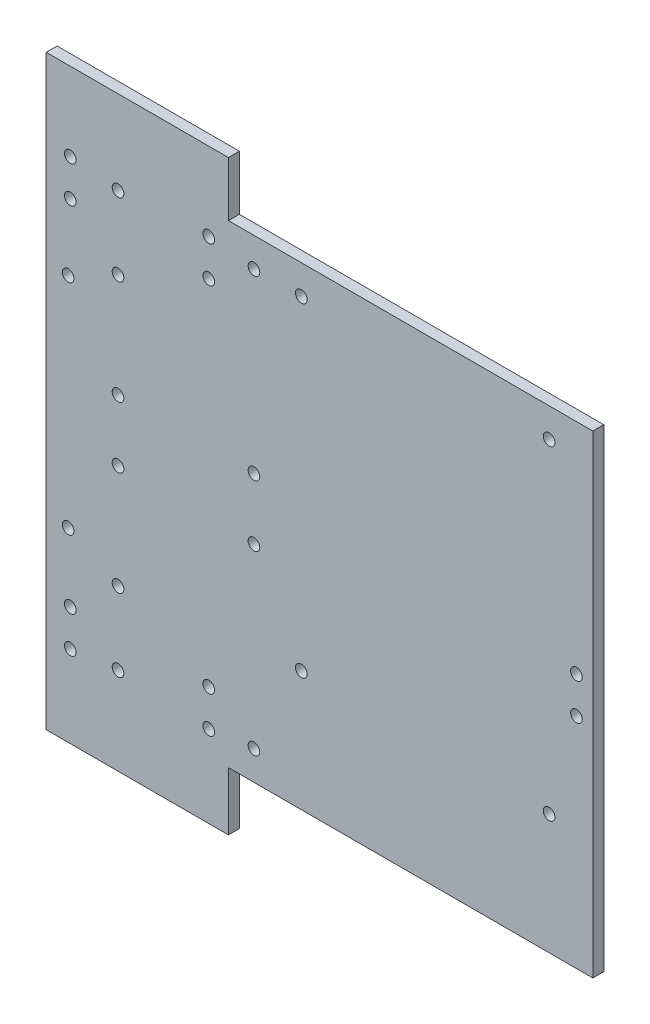
ISO-10303-21;
HEADER;
FILE_DESCRIPTION(('STEP AP214'),'2;1');
FILE_NAME('part.step','',(''),(''),'','','');
FILE_SCHEMA(('AUTOMOTIVE_DESIGN { 1 0 10303 214 1 1 1 1 }'));
ENDSEC;
DATA;
#1=APPLICATION_CONTEXT('core data for automotive mechanical design processes');
#2=APPLICATION_PROTOCOL_DEFINITION('international standard','automotive_design',2000,#1);
#3=PRODUCT_CONTEXT('',#1,'mechanical');
#4=PRODUCT('Part','Part','',(#3));
#5=PRODUCT_RELATED_PRODUCT_CATEGORY('part','',(#4));
#6=PRODUCT_DEFINITION_FORMATION('','',#4);
#7=PRODUCT_DEFINITION_CONTEXT('part definition',#1,'design');
#8=PRODUCT_DEFINITION('design','',#6,#7);
#9=PRODUCT_DEFINITION_SHAPE('','',#8);
#10=(LENGTH_UNIT() NAMED_UNIT(*) SI_UNIT(.MILLI.,.METRE.));
#11=(NAMED_UNIT(*) PLANE_ANGLE_UNIT() SI_UNIT($,.RADIAN.));
#12=(NAMED_UNIT(*) SI_UNIT($,.STERADIAN.) SOLID_ANGLE_UNIT());
#13=UNCERTAINTY_MEASURE_WITH_UNIT(LENGTH_MEASURE(1.E-05),#10,'distance_accuracy_value','');
#14=(GEOMETRIC_REPRESENTATION_CONTEXT(3) GLOBAL_UNCERTAINTY_ASSIGNED_CONTEXT((#13)) GLOBAL_UNIT_ASSIGNED_CONTEXT((#10,
#11,#12)) REPRESENTATION_CONTEXT('',''));
#15=CARTESIAN_POINT('',(0.,0.,0.));
#16=DIRECTION('',(0.,0.,1.));
#17=DIRECTION('',(1.,0.,0.));
#18=AXIS2_PLACEMENT_3D('',#15,#16,#17);
#19=CARTESIAN_POINT('',(-75.,65.,3.));
#20=DIRECTION('',(0.,-1.,0.));
#21=DIRECTION('',(0.,0.,-1.));
#22=AXIS2_PLACEMENT_3D('',#19,#20,#21);
#23=PLANE('',#22);
#24=DIRECTION('',(0.,0.,-1.));
#25=VECTOR('',#24,1.);
#26=CARTESIAN_POINT('',(-25.,65.,3.));
#27=LINE('',#26,#25);
#28=CARTESIAN_POINT('',(-25.,65.,3.));
#29=VERTEX_POINT('',#28);
#30=CARTESIAN_POINT('',(-25.,65.,0.));
#31=VERTEX_POINT('',#30);
#32=EDGE_CURVE('E58',#29,#31,#27,.T.);
#33=ORIENTED_EDGE('',*,*,#32,.F.);
#34=DIRECTION('',(-1.,0.,0.));
#35=VECTOR('',#34,1.);
#36=CARTESIAN_POINT('',(-75.,65.,3.));
#37=LINE('',#36,#35);
#38=CARTESIAN_POINT('',(75.,65.,3.));
#39=VERTEX_POINT('',#38);
#40=EDGE_CURVE('E123',#39,#29,#37,.T.);
#41=ORIENTED_EDGE('',*,*,#40,.F.);
#42=DIRECTION('',(0.,0.,-1.));
#43=VECTOR('',#42,1.);
#44=CARTESIAN_POINT('',(75.,65.,3.));
#45=LINE('',#44,#43);
#46=CARTESIAN_POINT('',(75.,65.,0.));
#47=VERTEX_POINT('',#46);
#48=EDGE_CURVE('E11',#39,#47,#45,.T.);
#49=ORIENTED_EDGE('',*,*,#48,.T.);
#50=DIRECTION('',(-1.,0.,0.));
#51=VECTOR('',#50,1.);
#52=CARTESIAN_POINT('',(-75.,65.,0.));
#53=LINE('',#52,#51);
#54=EDGE_CURVE('E130',#47,#31,#53,.T.);
#55=ORIENTED_EDGE('',*,*,#54,.T.);
#56=EDGE_LOOP('',(#33,#41,#49,#55));
#57=FACE_BOUND('',#56,.T.);
#58=ADVANCED_FACE('F33',(#57),#23,.F.);
#59=CARTESIAN_POINT('',(75.,-65.,3.));
#60=DIRECTION('',(-1.,0.,0.));
#61=DIRECTION('',(0.,0.,1.));
#62=AXIS2_PLACEMENT_3D('',#59,#60,#61);
#63=PLANE('',#62);
#64=DIRECTION('',(0.,1.,0.));
#65=VECTOR('',#64,1.);
#66=CARTESIAN_POINT('',(75.,-65.,0.));
#67=LINE('',#66,#65);
#68=CARTESIAN_POINT('',(75.,-65.,0.));
#69=VERTEX_POINT('',#68);
#70=EDGE_CURVE('E127',#69,#47,#67,.T.);
#71=ORIENTED_EDGE('',*,*,#70,.T.);
#72=ORIENTED_EDGE('',*,*,#48,.F.);
#73=DIRECTION('',(0.,1.,0.));
#74=VECTOR('',#73,1.);
#75=CARTESIAN_POINT('',(75.,-65.,3.));
#76=LINE('',#75,#74);
#77=CARTESIAN_POINT('',(75.,-65.,3.));
#78=VERTEX_POINT('',#77);
#79=EDGE_CURVE('E135',#78,#39,#76,.T.);
#80=ORIENTED_EDGE('',*,*,#79,.F.);
#81=DIRECTION('',(0.,0.,-1.));
#82=VECTOR('',#81,1.);
#83=CARTESIAN_POINT('',(75.,-65.,3.));
#84=LINE('',#83,#82);
#85=EDGE_CURVE('E42',#78,#69,#84,.T.);
#86=ORIENTED_EDGE('',*,*,#85,.T.);
#87=EDGE_LOOP('',(#71,#72,#80,#86));
#88=FACE_BOUND('',#87,.T.);
#89=ADVANCED_FACE('F35',(#88),#63,.F.);
#90=CARTESIAN_POINT('',(-75.,-65.,3.));
#91=DIRECTION('',(1.,0.,0.));
#92=DIRECTION('',(0.,0.,-1.));
#93=AXIS2_PLACEMENT_3D('',#90,#91,#92);
#94=PLANE('',#93);
#95=DIRECTION('',(0.,-1.,0.));
#96=VECTOR('',#95,1.);
#97=CARTESIAN_POINT('',(-75.,-65.,0.));
#98=LINE('',#97,#96);
#99=CARTESIAN_POINT('',(-75.,80.,0.));
#100=VERTEX_POINT('',#99);
#101=CARTESIAN_POINT('',(-75.,-81.,0.));
#102=VERTEX_POINT('',#101);
#103=EDGE_CURVE('E132',#100,#102,#98,.T.);
#104=ORIENTED_EDGE('',*,*,#103,.T.);
#105=DIRECTION('',(0.,0.,-1.));
#106=VECTOR('',#105,1.);
#107=CARTESIAN_POINT('',(-75.,-81.,3.));
#108=LINE('',#107,#106);
#109=CARTESIAN_POINT('',(-75.,-81.,3.));
#110=VERTEX_POINT('',#109);
#111=EDGE_CURVE('E369',#110,#102,#108,.T.);
#112=ORIENTED_EDGE('',*,*,#111,.F.);
#113=DIRECTION('',(0.,-1.,0.));
#114=VECTOR('',#113,1.);
#115=CARTESIAN_POINT('',(-75.,-65.,3.));
#116=LINE('',#115,#114);
#117=CARTESIAN_POINT('',(-75.,80.,3.));
#118=VERTEX_POINT('',#117);
#119=EDGE_CURVE('E120',#118,#110,#116,.T.);
#120=ORIENTED_EDGE('',*,*,#119,.F.);
#121=DIRECTION('',(0.,0.,-1.));
#122=VECTOR('',#121,1.);
#123=CARTESIAN_POINT('',(-75.,80.,3.));
#124=LINE('',#123,#122);
#125=EDGE_CURVE('E356',#118,#100,#124,.T.);
#126=ORIENTED_EDGE('',*,*,#125,.T.);
#127=EDGE_LOOP('',(#104,#112,#120,#126));
#128=FACE_BOUND('',#127,.T.);
#129=ADVANCED_FACE('F388',(#128),#94,.F.);
#130=CARTESIAN_POINT('',(-75.,-65.,3.));
#131=DIRECTION('',(0.,1.,0.));
#132=DIRECTION('',(0.,0.,1.));
#133=AXIS2_PLACEMENT_3D('',#130,#131,#132);
#134=PLANE('',#133);
#135=DIRECTION('',(1.,0.,0.));
#136=VECTOR('',#135,1.);
#137=CARTESIAN_POINT('',(-75.,-65.,3.));
#138=LINE('',#137,#136);
#139=CARTESIAN_POINT('',(-25.,-65.,3.));
#140=VERTEX_POINT('',#139);
#141=EDGE_CURVE('E112',#140,#78,#138,.T.);
#142=ORIENTED_EDGE('',*,*,#141,.F.);
#143=DIRECTION('',(0.,0.,-1.));
#144=VECTOR('',#143,1.);
#145=CARTESIAN_POINT('',(-25.,-65.,3.));
#146=LINE('',#145,#144);
#147=CARTESIAN_POINT('',(-25.,-65.,0.));
#148=VERTEX_POINT('',#147);
#149=EDGE_CURVE('E98',#140,#148,#146,.T.);
#150=ORIENTED_EDGE('',*,*,#149,.T.);
#151=DIRECTION('',(1.,0.,0.));
#152=VECTOR('',#151,1.);
#153=CARTESIAN_POINT('',(-75.,-65.,0.));
#154=LINE('',#153,#152);
#155=EDGE_CURVE('E134',#148,#69,#154,.T.);
#156=ORIENTED_EDGE('',*,*,#155,.T.);
#157=ORIENTED_EDGE('',*,*,#85,.F.);
#158=EDGE_LOOP('',(#142,#150,#156,#157));
#159=FACE_BOUND('',#158,.T.);
#160=ADVANCED_FACE('F117',(#159),#134,.F.);
#161=CARTESIAN_POINT('',(0.,0.,3.));
#162=DIRECTION('',(0.,0.,-1.));
#163=DIRECTION('',(-1.,0.,0.));
#164=AXIS2_PLACEMENT_3D('',#161,#162,#163);
#165=PLANE('',#164);
#166=CARTESIAN_POINT('',(-55.3,8.40000000000001,3.));
#167=DIRECTION('',(0.,0.,1.));
#168=DIRECTION('',(1.,0.,0.));
#169=AXIS2_PLACEMENT_3D('',#166,#167,#168);
#170=CIRCLE('',#169,1.6);
#171=CARTESIAN_POINT('',(-53.7,8.40000000000001,3.));
#172=VERTEX_POINT('',#171);
#173=EDGE_CURVE('E303',#172,#172,#170,.T.);
#174=ORIENTED_EDGE('',*,*,#173,.F.);
#175=EDGE_LOOP('',(#174));
#176=FACE_BOUND('',#175,.T.);
#177=CARTESIAN_POINT('',(-55.3,57.,3.));
#178=DIRECTION('',(0.,0.,1.));
#179=DIRECTION('',(-1.,0.,0.));
#180=AXIS2_PLACEMENT_3D('',#177,#178,#179);
#181=CIRCLE('',#180,1.60000000000001);
#182=CARTESIAN_POINT('',(-56.9,57.,3.));
#183=VERTEX_POINT('',#182);
#184=EDGE_CURVE('E313',#183,#183,#181,.T.);
#185=ORIENTED_EDGE('',*,*,#184,.F.);
#186=EDGE_LOOP('',(#185));
#187=FACE_BOUND('',#186,.T.);
#188=CARTESIAN_POINT('',(-55.3,-57.,3.));
#189=DIRECTION('',(0.,0.,1.));
#190=DIRECTION('',(1.,0.,0.));
#191=AXIS2_PLACEMENT_3D('',#188,#189,#190);
#192=CIRCLE('',#191,1.60000000000001);
#193=CARTESIAN_POINT('',(-53.7,-57.,3.));
#194=VERTEX_POINT('',#193);
#195=EDGE_CURVE('E309',#194,#194,#192,.T.);
#196=ORIENTED_EDGE('',*,*,#195,.F.);
#197=EDGE_LOOP('',(#196));
#198=FACE_BOUND('',#197,.T.);
#199=CARTESIAN_POINT('',(-55.3,-8.40000000000003,3.));
#200=DIRECTION('',(0.,0.,1.));
#201=DIRECTION('',(-1.,0.,0.));
#202=AXIS2_PLACEMENT_3D('',#199,#200,#201);
#203=CIRCLE('',#202,1.6);
#204=CARTESIAN_POINT('',(-56.9,-8.40000000000003,3.));
#205=VERTEX_POINT('',#204);
#206=EDGE_CURVE('E306',#205,#205,#203,.T.);
#207=ORIENTED_EDGE('',*,*,#206,.F.);
#208=EDGE_LOOP('',(#207));
#209=FACE_BOUND('',#208,.T.);
#210=CARTESIAN_POINT('',(-18.,-8.40000000000001,3.));
#211=DIRECTION('',(0.,0.,1.));
#212=DIRECTION('',(1.,0.,0.));
#213=AXIS2_PLACEMENT_3D('',#210,#211,#212);
#214=CIRCLE('',#213,1.6);
#215=CARTESIAN_POINT('',(-16.4,-8.40000000000001,3.));
#216=VERTEX_POINT('',#215);
#217=EDGE_CURVE('E310',#216,#216,#214,.T.);
#218=ORIENTED_EDGE('',*,*,#217,.F.);
#219=EDGE_LOOP('',(#218));
#220=FACE_BOUND('',#219,.T.);
#221=CARTESIAN_POINT('',(-30.4,58.5,3.));
#222=DIRECTION('',(0.,0.,1.));
#223=DIRECTION('',(1.,0.,0.));
#224=AXIS2_PLACEMENT_3D('',#221,#222,#223);
#225=CIRCLE('',#224,1.6);
#226=CARTESIAN_POINT('',(-28.8,58.5,3.));
#227=VERTEX_POINT('',#226);
#228=EDGE_CURVE('E325',#227,#227,#225,.T.);
#229=ORIENTED_EDGE('',*,*,#228,.F.);
#230=EDGE_LOOP('',(#229));
#231=FACE_BOUND('',#230,.T.);
#232=CARTESIAN_POINT('',(-68.4,58.5,3.));
#233=DIRECTION('',(0.,0.,1.));
#234=DIRECTION('',(1.,0.,0.));
#235=AXIS2_PLACEMENT_3D('',#232,#233,#234);
#236=CIRCLE('',#235,1.60000000000001);
#237=CARTESIAN_POINT('',(-66.8,58.5,3.));
#238=VERTEX_POINT('',#237);
#239=EDGE_CURVE('E321',#238,#238,#236,.T.);
#240=ORIENTED_EDGE('',*,*,#239,.F.);
#241=EDGE_LOOP('',(#240));
#242=FACE_BOUND('',#241,.T.);
#243=CARTESIAN_POINT('',(-68.4,48.5,3.));
#244=DIRECTION('',(0.,0.,1.));
#245=DIRECTION('',(-1.,0.,0.));
#246=AXIS2_PLACEMENT_3D('',#243,#244,#245);
#247=CIRCLE('',#246,1.60000000000001);
#248=CARTESIAN_POINT('',(-70.,48.5,3.));
#249=VERTEX_POINT('',#248);
#250=EDGE_CURVE('E318',#249,#249,#247,.T.);
#251=ORIENTED_EDGE('',*,*,#250,.F.);
#252=EDGE_LOOP('',(#251));
#253=FACE_BOUND('',#252,.T.);
#254=CARTESIAN_POINT('',(70.5,5.,3.));
#255=DIRECTION('',(0.,0.,1.));
#256=DIRECTION('',(1.,0.,0.));
#257=AXIS2_PLACEMENT_3D('',#254,#255,#256);
#258=CIRCLE('',#257,1.60000000000001);
#259=CARTESIAN_POINT('',(72.1,5.,3.));
#260=VERTEX_POINT('',#259);
#261=EDGE_CURVE('E281',#260,#260,#258,.T.);
#262=ORIENTED_EDGE('',*,*,#261,.F.);
#263=EDGE_LOOP('',(#262));
#264=FACE_BOUND('',#263,.T.);
#265=CARTESIAN_POINT('',(-5.,57.,3.));
#266=DIRECTION('',(0.,0.,1.));
#267=DIRECTION('',(1.,0.,0.));
#268=AXIS2_PLACEMENT_3D('',#265,#266,#267);
#269=CIRCLE('',#268,1.6);
#270=CARTESIAN_POINT('',(-3.4,57.,3.));
#271=VERTEX_POINT('',#270);
#272=EDGE_CURVE('E289',#271,#271,#269,.T.);
#273=ORIENTED_EDGE('',*,*,#272,.F.);
#274=EDGE_LOOP('',(#273));
#275=FACE_BOUND('',#274,.T.);
#276=CARTESIAN_POINT('',(-5.,-32.,3.));
#277=DIRECTION('',(0.,0.,1.));
#278=DIRECTION('',(1.,0.,0.));
#279=AXIS2_PLACEMENT_3D('',#276,#277,#278);
#280=CIRCLE('',#279,1.6);
#281=CARTESIAN_POINT('',(-3.4,-32.,3.));
#282=VERTEX_POINT('',#281);
#283=EDGE_CURVE('E285',#282,#282,#280,.T.);
#284=ORIENTED_EDGE('',*,*,#283,.F.);
#285=EDGE_LOOP('',(#284));
#286=FACE_BOUND('',#285,.T.);
#287=CARTESIAN_POINT('',(63.,-32.,3.));
#288=DIRECTION('',(0.,0.,1.));
#289=DIRECTION('',(1.,0.,0.));
#290=AXIS2_PLACEMENT_3D('',#287,#288,#289);
#291=CIRCLE('',#290,1.60000000000001);
#292=CARTESIAN_POINT('',(64.6,-32.,3.));
#293=VERTEX_POINT('',#292);
#294=EDGE_CURVE('E282',#293,#293,#291,.T.);
#295=ORIENTED_EDGE('',*,*,#294,.F.);
#296=EDGE_LOOP('',(#295));
#297=FACE_BOUND('',#296,.T.);
#298=CARTESIAN_POINT('',(-18.,8.40000000000001,3.));
#299=DIRECTION('',(0.,0.,1.));
#300=DIRECTION('',(-1.,0.,0.));
#301=AXIS2_PLACEMENT_3D('',#298,#299,#300);
#302=CIRCLE('',#301,1.6);
#303=CARTESIAN_POINT('',(-19.6,8.40000000000001,3.));
#304=VERTEX_POINT('',#303);
#305=EDGE_CURVE('E300',#304,#304,#302,.T.);
#306=ORIENTED_EDGE('',*,*,#305,.F.);
#307=EDGE_LOOP('',(#306));
#308=FACE_BOUND('',#307,.T.);
#309=CARTESIAN_POINT('',(-18.,-57.,3.));
#310=DIRECTION('',(0.,0.,1.));
#311=DIRECTION('',(-1.,0.,0.));
#312=AXIS2_PLACEMENT_3D('',#309,#310,#311);
#313=CIRCLE('',#312,1.6);
#314=CARTESIAN_POINT('',(-19.6,-57.,3.));
#315=VERTEX_POINT('',#314);
#316=EDGE_CURVE('E297',#315,#315,#313,.T.);
#317=ORIENTED_EDGE('',*,*,#316,.F.);
#318=EDGE_LOOP('',(#317));
#319=FACE_BOUND('',#318,.T.);
#320=CARTESIAN_POINT('',(70.5,-5.,3.));
#321=DIRECTION('',(0.,0.,1.));
#322=DIRECTION('',(1.,0.,0.));
#323=AXIS2_PLACEMENT_3D('',#320,#321,#322);
#324=CIRCLE('',#323,1.60000000000001);
#325=CARTESIAN_POINT('',(72.1,-5.,3.));
#326=VERTEX_POINT('',#325);
#327=EDGE_CURVE('E294',#326,#326,#324,.T.);
#328=ORIENTED_EDGE('',*,*,#327,.F.);
#329=EDGE_LOOP('',(#328));
#330=FACE_BOUND('',#329,.T.);
#331=CARTESIAN_POINT('',(-18.,57.,3.));
#332=DIRECTION('',(0.,0.,1.));
#333=DIRECTION('',(1.,0.,0.));
#334=AXIS2_PLACEMENT_3D('',#331,#332,#333);
#335=CIRCLE('',#334,1.6);
#336=CARTESIAN_POINT('',(-16.4,57.,3.));
#337=VERTEX_POINT('',#336);
#338=EDGE_CURVE('E286',#337,#337,#335,.T.);
#339=ORIENTED_EDGE('',*,*,#338,.F.);
#340=EDGE_LOOP('',(#339));
#341=FACE_BOUND('',#340,.T.);
#342=CARTESIAN_POINT('',(-55.3,-37.,3.));
#343=DIRECTION('',(0.,0.,1.));
#344=DIRECTION('',(-1.,0.,0.));
#345=AXIS2_PLACEMENT_3D('',#342,#343,#344);
#346=CIRCLE('',#345,1.6);
#347=CARTESIAN_POINT('',(-56.9,-37.,3.));
#348=VERTEX_POINT('',#347);
#349=EDGE_CURVE('E346',#348,#348,#346,.T.);
#350=ORIENTED_EDGE('',*,*,#349,.F.);
#351=EDGE_LOOP('',(#350));
#352=FACE_BOUND('',#351,.T.);
#353=CARTESIAN_POINT('',(-30.4,48.5,3.));
#354=DIRECTION('',(0.,0.,1.));
#355=DIRECTION('',(-1.,0.,0.));
#356=AXIS2_PLACEMENT_3D('',#353,#354,#355);
#357=CIRCLE('',#356,1.60000000000001);
#358=CARTESIAN_POINT('',(-32.,48.5,3.));
#359=VERTEX_POINT('',#358);
#360=EDGE_CURVE('E322',#359,#359,#357,.T.);
#361=ORIENTED_EDGE('',*,*,#360,.F.);
#362=EDGE_LOOP('',(#361));
#363=FACE_BOUND('',#362,.T.);
#364=CARTESIAN_POINT('',(-68.4,-48.5,3.));
#365=DIRECTION('',(0.,0.,1.));
#366=DIRECTION('',(1.,0.,0.));
#367=AXIS2_PLACEMENT_3D('',#364,#365,#366);
#368=CIRCLE('',#367,1.60000000000001);
#369=CARTESIAN_POINT('',(-66.8,-48.5,3.));
#370=VERTEX_POINT('',#369);
#371=EDGE_CURVE('E337',#370,#370,#368,.T.);
#372=ORIENTED_EDGE('',*,*,#371,.F.);
#373=EDGE_LOOP('',(#372));
#374=FACE_BOUND('',#373,.T.);
#375=CARTESIAN_POINT('',(-68.4,-58.5,3.));
#376=DIRECTION('',(0.,0.,1.));
#377=DIRECTION('',(-1.,0.,0.));
#378=AXIS2_PLACEMENT_3D('',#375,#376,#377);
#379=CIRCLE('',#378,1.60000000000001);
#380=CARTESIAN_POINT('',(-70.,-58.5,3.));
#381=VERTEX_POINT('',#380);
#382=EDGE_CURVE('E333',#381,#381,#379,.T.);
#383=ORIENTED_EDGE('',*,*,#382,.F.);
#384=EDGE_LOOP('',(#383));
#385=FACE_BOUND('',#384,.T.);
#386=CARTESIAN_POINT('',(-30.4,-58.5,3.));
#387=DIRECTION('',(0.,0.,1.));
#388=DIRECTION('',(-1.,0.,0.));
#389=AXIS2_PLACEMENT_3D('',#386,#387,#388);
#390=CIRCLE('',#389,1.59999999999999);
#391=CARTESIAN_POINT('',(-32.,-58.5,3.));
#392=VERTEX_POINT('',#391);
#393=EDGE_CURVE('E330',#392,#392,#390,.T.);
#394=ORIENTED_EDGE('',*,*,#393,.F.);
#395=EDGE_LOOP('',(#394));
#396=FACE_BOUND('',#395,.T.);
#397=CARTESIAN_POINT('',(-30.4,-48.5,3.));
#398=DIRECTION('',(0.,0.,1.));
#399=DIRECTION('',(1.,0.,0.));
#400=AXIS2_PLACEMENT_3D('',#397,#398,#399);
#401=CIRCLE('',#400,1.59999999999999);
#402=CARTESIAN_POINT('',(-28.8,-48.5,3.));
#403=VERTEX_POINT('',#402);
#404=EDGE_CURVE('E334',#403,#403,#401,.T.);
#405=ORIENTED_EDGE('',*,*,#404,.F.);
#406=EDGE_LOOP('',(#405));
#407=FACE_BOUND('',#406,.T.);
#408=CARTESIAN_POINT('',(-69.,-30.,3.));
#409=DIRECTION('',(0.,0.,1.));
#410=DIRECTION('',(1.,0.,0.));
#411=AXIS2_PLACEMENT_3D('',#408,#409,#410);
#412=CIRCLE('',#411,1.6);
#413=CARTESIAN_POINT('',(-67.4,-30.,3.));
#414=VERTEX_POINT('',#413);
#415=EDGE_CURVE('E349',#414,#414,#412,.T.);
#416=ORIENTED_EDGE('',*,*,#415,.F.);
#417=EDGE_LOOP('',(#416));
#418=FACE_BOUND('',#417,.T.);
#419=CARTESIAN_POINT('',(-69.,30.,3.));
#420=DIRECTION('',(0.,0.,1.));
#421=DIRECTION('',(-1.,0.,0.));
#422=AXIS2_PLACEMENT_3D('',#419,#420,#421);
#423=CIRCLE('',#422,1.6);
#424=CARTESIAN_POINT('',(-70.6,30.,3.));
#425=VERTEX_POINT('',#424);
#426=EDGE_CURVE('E345',#425,#425,#423,.T.);
#427=ORIENTED_EDGE('',*,*,#426,.F.);
#428=EDGE_LOOP('',(#427));
#429=FACE_BOUND('',#428,.T.);
#430=CARTESIAN_POINT('',(-55.3,37.,3.));
#431=DIRECTION('',(0.,0.,1.));
#432=DIRECTION('',(1.,0.,0.));
#433=AXIS2_PLACEMENT_3D('',#430,#431,#432);
#434=CIRCLE('',#433,1.6);
#435=CARTESIAN_POINT('',(-53.7,37.,3.));
#436=VERTEX_POINT('',#435);
#437=EDGE_CURVE('E342',#436,#436,#434,.T.);
#438=ORIENTED_EDGE('',*,*,#437,.F.);
#439=EDGE_LOOP('',(#438));
#440=FACE_BOUND('',#439,.T.);
#441=CARTESIAN_POINT('',(63.,57.,3.));
#442=DIRECTION('',(0.,0.,1.));
#443=DIRECTION('',(1.,0.,0.));
#444=AXIS2_PLACEMENT_3D('',#441,#442,#443);
#445=CIRCLE('',#444,1.60000000000001);
#446=CARTESIAN_POINT('',(64.6,57.,3.));
#447=VERTEX_POINT('',#446);
#448=EDGE_CURVE('E141',#447,#447,#445,.T.);
#449=ORIENTED_EDGE('',*,*,#448,.F.);
#450=EDGE_LOOP('',(#449));
#451=FACE_BOUND('',#450,.T.);
#452=ORIENTED_EDGE('',*,*,#79,.T.);
#453=ORIENTED_EDGE('',*,*,#40,.T.);
#454=DIRECTION('',(0.,-1.,0.));
#455=VECTOR('',#454,1.);
#456=CARTESIAN_POINT('',(-25.,80.,3.));
#457=LINE('',#456,#455);
#458=CARTESIAN_POINT('',(-25.,80.,3.));
#459=VERTEX_POINT('',#458);
#460=EDGE_CURVE('E360',#459,#29,#457,.T.);
#461=ORIENTED_EDGE('',*,*,#460,.F.);
#462=DIRECTION('',(1.,0.,0.));
#463=VECTOR('',#462,1.);
#464=CARTESIAN_POINT('',(-75.,80.,3.));
#465=LINE('',#464,#463);
#466=EDGE_CURVE('E365',#118,#459,#465,.T.);
#467=ORIENTED_EDGE('',*,*,#466,.F.);
#468=ORIENTED_EDGE('',*,*,#119,.T.);
#469=DIRECTION('',(-1.,0.,0.));
#470=VECTOR('',#469,1.);
#471=CARTESIAN_POINT('',(-75.,-81.,3.));
#472=LINE('',#471,#470);
#473=CARTESIAN_POINT('',(-25.,-81.,3.));
#474=VERTEX_POINT('',#473);
#475=EDGE_CURVE('E106',#474,#110,#472,.T.);
#476=ORIENTED_EDGE('',*,*,#475,.F.);
#477=DIRECTION('',(0.,-1.,0.));
#478=VECTOR('',#477,1.);
#479=CARTESIAN_POINT('',(-25.,-81.,3.));
#480=LINE('',#479,#478);
#481=EDGE_CURVE('E101',#140,#474,#480,.T.);
#482=ORIENTED_EDGE('',*,*,#481,.F.);
#483=ORIENTED_EDGE('',*,*,#141,.T.);
#484=EDGE_LOOP('',(#452,#453,#461,#467,#468,#476,#482,#483));
#485=FACE_BOUND('',#484,.T.);
#486=ADVANCED_FACE('F111',(#176,#187,#198,#209,#220,#231,#242,#253,#264,#275,#286,#297,#308,
#319,#330,#341,#352,#363,#374,#385,#396,#407,#418,#429,#440,#451,#485),#165,.F.);
#487=CARTESIAN_POINT('',(0.,0.,0.));
#488=DIRECTION('',(0.,0.,-1.));
#489=DIRECTION('',(-1.,0.,0.));
#490=AXIS2_PLACEMENT_3D('',#487,#488,#489);
#491=PLANE('',#490);
#492=CARTESIAN_POINT('',(-55.3,8.40000000000001,0.));
#493=DIRECTION('',(0.,0.,-1.));
#494=DIRECTION('',(-1.,0.,0.));
#495=AXIS2_PLACEMENT_3D('',#492,#493,#494);
#496=CIRCLE('',#495,1.6);
#497=CARTESIAN_POINT('',(-56.9,8.40000000000001,0.));
#498=VERTEX_POINT('',#497);
#499=EDGE_CURVE('E37',#498,#498,#496,.T.);
#500=ORIENTED_EDGE('',*,*,#499,.F.);
#501=EDGE_LOOP('',(#500));
#502=FACE_BOUND('',#501,.T.);
#503=CARTESIAN_POINT('',(-55.3,57.,0.));
#504=DIRECTION('',(0.,0.,-1.));
#505=DIRECTION('',(-1.,0.,0.));
#506=AXIS2_PLACEMENT_3D('',#503,#504,#505);
#507=CIRCLE('',#506,1.60000000000001);
#508=CARTESIAN_POINT('',(-56.9,57.,0.));
#509=VERTEX_POINT('',#508);
#510=EDGE_CURVE('E209',#509,#509,#507,.T.);
#511=ORIENTED_EDGE('',*,*,#510,.F.);
#512=EDGE_LOOP('',(#511));
#513=FACE_BOUND('',#512,.T.);
#514=CARTESIAN_POINT('',(-55.3,-57.,0.));
#515=DIRECTION('',(0.,0.,-1.));
#516=DIRECTION('',(-1.,0.,0.));
#517=AXIS2_PLACEMENT_3D('',#514,#515,#516);
#518=CIRCLE('',#517,1.60000000000001);
#519=CARTESIAN_POINT('',(-56.9,-57.,0.));
#520=VERTEX_POINT('',#519);
#521=EDGE_CURVE('E207',#520,#520,#518,.T.);
#522=ORIENTED_EDGE('',*,*,#521,.F.);
#523=EDGE_LOOP('',(#522));
#524=FACE_BOUND('',#523,.T.);
#525=CARTESIAN_POINT('',(-55.3,-8.40000000000003,0.));
#526=DIRECTION('',(0.,0.,-1.));
#527=DIRECTION('',(-1.,0.,0.));
#528=AXIS2_PLACEMENT_3D('',#525,#526,#527);
#529=CIRCLE('',#528,1.6);
#530=CARTESIAN_POINT('',(-56.9,-8.40000000000003,0.));
#531=VERTEX_POINT('',#530);
#532=EDGE_CURVE('E204',#531,#531,#529,.T.);
#533=ORIENTED_EDGE('',*,*,#532,.F.);
#534=EDGE_LOOP('',(#533));
#535=FACE_BOUND('',#534,.T.);
#536=CARTESIAN_POINT('',(-18.,-8.40000000000001,0.));
#537=DIRECTION('',(0.,0.,-1.));
#538=DIRECTION('',(-1.,0.,0.));
#539=AXIS2_PLACEMENT_3D('',#536,#537,#538);
#540=CIRCLE('',#539,1.6);
#541=CARTESIAN_POINT('',(-19.6,-8.40000000000001,0.));
#542=VERTEX_POINT('',#541);
#543=EDGE_CURVE('E201',#542,#542,#540,.T.);
#544=ORIENTED_EDGE('',*,*,#543,.F.);
#545=EDGE_LOOP('',(#544));
#546=FACE_BOUND('',#545,.T.);
#547=CARTESIAN_POINT('',(-30.4,58.5,0.));
#548=DIRECTION('',(0.,0.,-1.));
#549=DIRECTION('',(-1.,0.,0.));
#550=AXIS2_PLACEMENT_3D('',#547,#548,#549);
#551=CIRCLE('',#550,1.6);
#552=CARTESIAN_POINT('',(-32.,58.5,0.));
#553=VERTEX_POINT('',#552);
#554=EDGE_CURVE('E198',#553,#553,#551,.T.);
#555=ORIENTED_EDGE('',*,*,#554,.F.);
#556=EDGE_LOOP('',(#555));
#557=FACE_BOUND('',#556,.T.);
#558=CARTESIAN_POINT('',(-68.4,58.5,0.));
#559=DIRECTION('',(0.,0.,-1.));
#560=DIRECTION('',(-1.,0.,0.));
#561=AXIS2_PLACEMENT_3D('',#558,#559,#560);
#562=CIRCLE('',#561,1.60000000000001);
#563=CARTESIAN_POINT('',(-70.,58.5,0.));
#564=VERTEX_POINT('',#563);
#565=EDGE_CURVE('E195',#564,#564,#562,.T.);
#566=ORIENTED_EDGE('',*,*,#565,.F.);
#567=EDGE_LOOP('',(#566));
#568=FACE_BOUND('',#567,.T.);
#569=CARTESIAN_POINT('',(-68.4,48.5,0.));
#570=DIRECTION('',(0.,0.,-1.));
#571=DIRECTION('',(-1.,0.,0.));
#572=AXIS2_PLACEMENT_3D('',#569,#570,#571);
#573=CIRCLE('',#572,1.60000000000001);
#574=CARTESIAN_POINT('',(-70.,48.5,0.));
#575=VERTEX_POINT('',#574);
#576=EDGE_CURVE('E192',#575,#575,#573,.T.);
#577=ORIENTED_EDGE('',*,*,#576,.F.);
#578=EDGE_LOOP('',(#577));
#579=FACE_BOUND('',#578,.T.);
#580=CARTESIAN_POINT('',(70.5,5.,0.));
#581=DIRECTION('',(0.,0.,-1.));
#582=DIRECTION('',(-1.,0.,0.));
#583=AXIS2_PLACEMENT_3D('',#580,#581,#582);
#584=CIRCLE('',#583,1.60000000000001);
#585=CARTESIAN_POINT('',(68.9,5.,0.));
#586=VERTEX_POINT('',#585);
#587=EDGE_CURVE('E189',#586,#586,#584,.T.);
#588=ORIENTED_EDGE('',*,*,#587,.F.);
#589=EDGE_LOOP('',(#588));
#590=FACE_BOUND('',#589,.T.);
#591=CARTESIAN_POINT('',(-5.,57.,0.));
#592=DIRECTION('',(0.,0.,-1.));
#593=DIRECTION('',(-1.,0.,0.));
#594=AXIS2_PLACEMENT_3D('',#591,#592,#593);
#595=CIRCLE('',#594,1.6);
#596=CARTESIAN_POINT('',(-6.6,57.,0.));
#597=VERTEX_POINT('',#596);
#598=EDGE_CURVE('E186',#597,#597,#595,.T.);
#599=ORIENTED_EDGE('',*,*,#598,.F.);
#600=EDGE_LOOP('',(#599));
#601=FACE_BOUND('',#600,.T.);
#602=CARTESIAN_POINT('',(-5.,-32.,0.));
#603=DIRECTION('',(0.,0.,-1.));
#604=DIRECTION('',(-1.,0.,0.));
#605=AXIS2_PLACEMENT_3D('',#602,#603,#604);
#606=CIRCLE('',#605,1.6);
#607=CARTESIAN_POINT('',(-6.6,-32.,0.));
#608=VERTEX_POINT('',#607);
#609=EDGE_CURVE('E183',#608,#608,#606,.T.);
#610=ORIENTED_EDGE('',*,*,#609,.F.);
#611=EDGE_LOOP('',(#610));
#612=FACE_BOUND('',#611,.T.);
#613=CARTESIAN_POINT('',(63.,-32.,0.));
#614=DIRECTION('',(0.,0.,-1.));
#615=DIRECTION('',(-1.,0.,0.));
#616=AXIS2_PLACEMENT_3D('',#613,#614,#615);
#617=CIRCLE('',#616,1.60000000000001);
#618=CARTESIAN_POINT('',(61.4,-32.,0.));
#619=VERTEX_POINT('',#618);
#620=EDGE_CURVE('E180',#619,#619,#617,.T.);
#621=ORIENTED_EDGE('',*,*,#620,.F.);
#622=EDGE_LOOP('',(#621));
#623=FACE_BOUND('',#622,.T.);
#624=CARTESIAN_POINT('',(-18.,8.40000000000001,0.));
#625=DIRECTION('',(0.,0.,-1.));
#626=DIRECTION('',(-1.,0.,0.));
#627=AXIS2_PLACEMENT_3D('',#624,#625,#626);
#628=CIRCLE('',#627,1.6);
#629=CARTESIAN_POINT('',(-19.6,8.40000000000001,0.));
#630=VERTEX_POINT('',#629);
#631=EDGE_CURVE('E177',#630,#630,#628,.T.);
#632=ORIENTED_EDGE('',*,*,#631,.F.);
#633=EDGE_LOOP('',(#632));
#634=FACE_BOUND('',#633,.T.);
#635=CARTESIAN_POINT('',(-18.,-57.,0.));
#636=DIRECTION('',(0.,0.,-1.));
#637=DIRECTION('',(-1.,0.,0.));
#638=AXIS2_PLACEMENT_3D('',#635,#636,#637);
#639=CIRCLE('',#638,1.6);
#640=CARTESIAN_POINT('',(-19.6,-57.,0.));
#641=VERTEX_POINT('',#640);
#642=EDGE_CURVE('E174',#641,#641,#639,.T.);
#643=ORIENTED_EDGE('',*,*,#642,.F.);
#644=EDGE_LOOP('',(#643));
#645=FACE_BOUND('',#644,.T.);
#646=CARTESIAN_POINT('',(70.5,-5.,0.));
#647=DIRECTION('',(0.,0.,-1.));
#648=DIRECTION('',(-1.,0.,0.));
#649=AXIS2_PLACEMENT_3D('',#646,#647,#648);
#650=CIRCLE('',#649,1.60000000000001);
#651=CARTESIAN_POINT('',(68.9,-5.,0.));
#652=VERTEX_POINT('',#651);
#653=EDGE_CURVE('E171',#652,#652,#650,.T.);
#654=ORIENTED_EDGE('',*,*,#653,.F.);
#655=EDGE_LOOP('',(#654));
#656=FACE_BOUND('',#655,.T.);
#657=CARTESIAN_POINT('',(-18.,57.,0.));
#658=DIRECTION('',(0.,0.,-1.));
#659=DIRECTION('',(-1.,0.,0.));
#660=AXIS2_PLACEMENT_3D('',#657,#658,#659);
#661=CIRCLE('',#660,1.6);
#662=CARTESIAN_POINT('',(-19.6,57.,0.));
#663=VERTEX_POINT('',#662);
#664=EDGE_CURVE('E168',#663,#663,#661,.T.);
#665=ORIENTED_EDGE('',*,*,#664,.F.);
#666=EDGE_LOOP('',(#665));
#667=FACE_BOUND('',#666,.T.);
#668=CARTESIAN_POINT('',(-55.3,-37.,0.));
#669=DIRECTION('',(0.,0.,-1.));
#670=DIRECTION('',(-1.,0.,0.));
#671=AXIS2_PLACEMENT_3D('',#668,#669,#670);
#672=CIRCLE('',#671,1.6);
#673=CARTESIAN_POINT('',(-56.9,-37.,0.));
#674=VERTEX_POINT('',#673);
#675=EDGE_CURVE('E165',#674,#674,#672,.T.);
#676=ORIENTED_EDGE('',*,*,#675,.F.);
#677=EDGE_LOOP('',(#676));
#678=FACE_BOUND('',#677,.T.);
#679=CARTESIAN_POINT('',(-30.4,48.5,0.));
#680=DIRECTION('',(0.,0.,-1.));
#681=DIRECTION('',(-1.,0.,0.));
#682=AXIS2_PLACEMENT_3D('',#679,#680,#681);
#683=CIRCLE('',#682,1.60000000000001);
#684=CARTESIAN_POINT('',(-32.,48.5,0.));
#685=VERTEX_POINT('',#684);
#686=EDGE_CURVE('E162',#685,#685,#683,.T.);
#687=ORIENTED_EDGE('',*,*,#686,.F.);
#688=EDGE_LOOP('',(#687));
#689=FACE_BOUND('',#688,.T.);
#690=CARTESIAN_POINT('',(-68.4,-48.5,0.));
#691=DIRECTION('',(0.,0.,-1.));
#692=DIRECTION('',(-1.,0.,0.));
#693=AXIS2_PLACEMENT_3D('',#690,#691,#692);
#694=CIRCLE('',#693,1.60000000000001);
#695=CARTESIAN_POINT('',(-70.,-48.5,0.));
#696=VERTEX_POINT('',#695);
#697=EDGE_CURVE('E159',#696,#696,#694,.T.);
#698=ORIENTED_EDGE('',*,*,#697,.F.);
#699=EDGE_LOOP('',(#698));
#700=FACE_BOUND('',#699,.T.);
#701=CARTESIAN_POINT('',(-68.4,-58.5,0.));
#702=DIRECTION('',(0.,0.,-1.));
#703=DIRECTION('',(-1.,0.,0.));
#704=AXIS2_PLACEMENT_3D('',#701,#702,#703);
#705=CIRCLE('',#704,1.60000000000001);
#706=CARTESIAN_POINT('',(-70.,-58.5,0.));
#707=VERTEX_POINT('',#706);
#708=EDGE_CURVE('E156',#707,#707,#705,.T.);
#709=ORIENTED_EDGE('',*,*,#708,.F.);
#710=EDGE_LOOP('',(#709));
#711=FACE_BOUND('',#710,.T.);
#712=CARTESIAN_POINT('',(-30.4,-58.5,0.));
#713=DIRECTION('',(0.,0.,-1.));
#714=DIRECTION('',(-1.,0.,0.));
#715=AXIS2_PLACEMENT_3D('',#712,#713,#714);
#716=CIRCLE('',#715,1.59999999999999);
#717=CARTESIAN_POINT('',(-32.,-58.5,0.));
#718=VERTEX_POINT('',#717);
#719=EDGE_CURVE('E153',#718,#718,#716,.T.);
#720=ORIENTED_EDGE('',*,*,#719,.F.);
#721=EDGE_LOOP('',(#720));
#722=FACE_BOUND('',#721,.T.);
#723=CARTESIAN_POINT('',(-30.4,-48.5,0.));
#724=DIRECTION('',(0.,0.,-1.));
#725=DIRECTION('',(-1.,0.,0.));
#726=AXIS2_PLACEMENT_3D('',#723,#724,#725);
#727=CIRCLE('',#726,1.59999999999999);
#728=CARTESIAN_POINT('',(-32.,-48.5,0.));
#729=VERTEX_POINT('',#728);
#730=EDGE_CURVE('E150',#729,#729,#727,.T.);
#731=ORIENTED_EDGE('',*,*,#730,.F.);
#732=EDGE_LOOP('',(#731));
#733=FACE_BOUND('',#732,.T.);
#734=CARTESIAN_POINT('',(-69.,-30.,0.));
#735=DIRECTION('',(0.,0.,-1.));
#736=DIRECTION('',(-1.,0.,0.));
#737=AXIS2_PLACEMENT_3D('',#734,#735,#736);
#738=CIRCLE('',#737,1.6);
#739=CARTESIAN_POINT('',(-70.6,-30.,0.));
#740=VERTEX_POINT('',#739);
#741=EDGE_CURVE('E147',#740,#740,#738,.T.);
#742=ORIENTED_EDGE('',*,*,#741,.F.);
#743=EDGE_LOOP('',(#742));
#744=FACE_BOUND('',#743,.T.);
#745=CARTESIAN_POINT('',(-69.,30.,0.));
#746=DIRECTION('',(0.,0.,-1.));
#747=DIRECTION('',(-1.,0.,0.));
#748=AXIS2_PLACEMENT_3D('',#745,#746,#747);
#749=CIRCLE('',#748,1.6);
#750=CARTESIAN_POINT('',(-70.6,30.,0.));
#751=VERTEX_POINT('',#750);
#752=EDGE_CURVE('E144',#751,#751,#749,.T.);
#753=ORIENTED_EDGE('',*,*,#752,.F.);
#754=EDGE_LOOP('',(#753));
#755=FACE_BOUND('',#754,.T.);
#756=CARTESIAN_POINT('',(-55.3,37.,0.));
#757=DIRECTION('',(0.,0.,-1.));
#758=DIRECTION('',(-1.,0.,0.));
#759=AXIS2_PLACEMENT_3D('',#756,#757,#758);
#760=CIRCLE('',#759,1.6);
#761=CARTESIAN_POINT('',(-56.9,37.,0.));
#762=VERTEX_POINT('',#761);
#763=EDGE_CURVE('E140',#762,#762,#760,.T.);
#764=ORIENTED_EDGE('',*,*,#763,.F.);
#765=EDGE_LOOP('',(#764));
#766=FACE_BOUND('',#765,.T.);
#767=CARTESIAN_POINT('',(63.,57.,0.));
#768=DIRECTION('',(0.,0.,-1.));
#769=DIRECTION('',(-1.,0.,0.));
#770=AXIS2_PLACEMENT_3D('',#767,#768,#769);
#771=CIRCLE('',#770,1.60000000000001);
#772=CARTESIAN_POINT('',(61.4,57.,0.));
#773=VERTEX_POINT('',#772);
#774=EDGE_CURVE('E137',#773,#773,#771,.T.);
#775=ORIENTED_EDGE('',*,*,#774,.F.);
#776=EDGE_LOOP('',(#775));
#777=FACE_BOUND('',#776,.T.);
#778=ORIENTED_EDGE('',*,*,#70,.F.);
#779=ORIENTED_EDGE('',*,*,#155,.F.);
#780=DIRECTION('',(0.,-1.,0.));
#781=VECTOR('',#780,1.);
#782=CARTESIAN_POINT('',(-25.,-81.,0.));
#783=LINE('',#782,#781);
#784=CARTESIAN_POINT('',(-25.,-81.,0.));
#785=VERTEX_POINT('',#784);
#786=EDGE_CURVE('E50',#148,#785,#783,.T.);
#787=ORIENTED_EDGE('',*,*,#786,.T.);
#788=DIRECTION('',(-1.,0.,0.));
#789=VECTOR('',#788,1.);
#790=CARTESIAN_POINT('',(-75.,-81.,0.));
#791=LINE('',#790,#789);
#792=EDGE_CURVE('E115',#785,#102,#791,.T.);
#793=ORIENTED_EDGE('',*,*,#792,.T.);
#794=ORIENTED_EDGE('',*,*,#103,.F.);
#795=DIRECTION('',(1.,0.,0.));
#796=VECTOR('',#795,1.);
#797=CARTESIAN_POINT('',(-75.,80.,0.));
#798=LINE('',#797,#796);
#799=CARTESIAN_POINT('',(-25.,80.,0.));
#800=VERTEX_POINT('',#799);
#801=EDGE_CURVE('E366',#100,#800,#798,.T.);
#802=ORIENTED_EDGE('',*,*,#801,.T.);
#803=DIRECTION('',(0.,-1.,0.));
#804=VECTOR('',#803,1.);
#805=CARTESIAN_POINT('',(-25.,80.,0.));
#806=LINE('',#805,#804);
#807=EDGE_CURVE('E363',#800,#31,#806,.T.);
#808=ORIENTED_EDGE('',*,*,#807,.T.);
#809=ORIENTED_EDGE('',*,*,#54,.F.);
#810=EDGE_LOOP('',(#778,#779,#787,#793,#794,#802,#808,#809));
#811=FACE_BOUND('',#810,.T.);
#812=ADVANCED_FACE('F219',(#502,#513,#524,#535,#546,#557,#568,#579,#590,#601,#612,#623,#634,
#645,#656,#667,#678,#689,#700,#711,#722,#733,#744,#755,#766,#777,#811),#491,.T.);
#813=CARTESIAN_POINT('',(63.,57.,-20.));
#814=DIRECTION('',(0.,0.,1.));
#815=DIRECTION('',(1.,0.,0.));
#816=AXIS2_PLACEMENT_3D('',#813,#814,#815);
#817=CYLINDRICAL_SURFACE('',#816,1.60000000000001);
#818=ORIENTED_EDGE('',*,*,#774,.T.);
#819=EDGE_LOOP('',(#818));
#820=FACE_BOUND('',#819,.T.);
#821=ORIENTED_EDGE('',*,*,#448,.T.);
#822=EDGE_LOOP('',(#821));
#823=FACE_BOUND('',#822,.T.);
#824=ADVANCED_FACE('F222',(#820,#823),#817,.F.);
#825=CARTESIAN_POINT('',(-55.3,37.,-20.));
#826=DIRECTION('',(0.,0.,1.));
#827=DIRECTION('',(1.,0.,0.));
#828=AXIS2_PLACEMENT_3D('',#825,#826,#827);
#829=CYLINDRICAL_SURFACE('',#828,1.6);
#830=ORIENTED_EDGE('',*,*,#763,.T.);
#831=EDGE_LOOP('',(#830));
#832=FACE_BOUND('',#831,.T.);
#833=ORIENTED_EDGE('',*,*,#437,.T.);
#834=EDGE_LOOP('',(#833));
#835=FACE_BOUND('',#834,.T.);
#836=ADVANCED_FACE('F411',(#832,#835),#829,.F.);
#837=CARTESIAN_POINT('',(-69.,30.,-20.));
#838=DIRECTION('',(0.,0.,1.));
#839=DIRECTION('',(1.,0.,0.));
#840=AXIS2_PLACEMENT_3D('',#837,#838,#839);
#841=CYLINDRICAL_SURFACE('',#840,1.6);
#842=ORIENTED_EDGE('',*,*,#752,.T.);
#843=EDGE_LOOP('',(#842));
#844=FACE_BOUND('',#843,.T.);
#845=ORIENTED_EDGE('',*,*,#426,.T.);
#846=EDGE_LOOP('',(#845));
#847=FACE_BOUND('',#846,.T.);
#848=ADVANCED_FACE('F494',(#844,#847),#841,.F.);
#849=CARTESIAN_POINT('',(-69.,-30.,-20.));
#850=DIRECTION('',(0.,0.,1.));
#851=DIRECTION('',(1.,0.,0.));
#852=AXIS2_PLACEMENT_3D('',#849,#850,#851);
#853=CYLINDRICAL_SURFACE('',#852,1.6);
#854=ORIENTED_EDGE('',*,*,#741,.T.);
#855=EDGE_LOOP('',(#854));
#856=FACE_BOUND('',#855,.T.);
#857=ORIENTED_EDGE('',*,*,#415,.T.);
#858=EDGE_LOOP('',(#857));
#859=FACE_BOUND('',#858,.T.);
#860=ADVANCED_FACE('F498',(#856,#859),#853,.F.);
#861=CARTESIAN_POINT('',(-30.4,-48.5,-20.));
#862=DIRECTION('',(0.,0.,1.));
#863=DIRECTION('',(1.,0.,0.));
#864=AXIS2_PLACEMENT_3D('',#861,#862,#863);
#865=CYLINDRICAL_SURFACE('',#864,1.59999999999999);
#866=ORIENTED_EDGE('',*,*,#730,.T.);
#867=EDGE_LOOP('',(#866));
#868=FACE_BOUND('',#867,.T.);
#869=ORIENTED_EDGE('',*,*,#404,.T.);
#870=EDGE_LOOP('',(#869));
#871=FACE_BOUND('',#870,.T.);
#872=ADVANCED_FACE('F479',(#868,#871),#865,.F.);
#873=CARTESIAN_POINT('',(-30.4,-58.5,-20.));
#874=DIRECTION('',(0.,0.,1.));
#875=DIRECTION('',(1.,0.,0.));
#876=AXIS2_PLACEMENT_3D('',#873,#874,#875);
#877=CYLINDRICAL_SURFACE('',#876,1.59999999999999);
#878=ORIENTED_EDGE('',*,*,#719,.T.);
#879=EDGE_LOOP('',(#878));
#880=FACE_BOUND('',#879,.T.);
#881=ORIENTED_EDGE('',*,*,#393,.T.);
#882=EDGE_LOOP('',(#881));
#883=FACE_BOUND('',#882,.T.);
#884=ADVANCED_FACE('F475',(#880,#883),#877,.F.);
#885=CARTESIAN_POINT('',(-68.4,-58.5,-20.));
#886=DIRECTION('',(0.,0.,1.));
#887=DIRECTION('',(1.,0.,0.));
#888=AXIS2_PLACEMENT_3D('',#885,#886,#887);
#889=CYLINDRICAL_SURFACE('',#888,1.60000000000001);
#890=ORIENTED_EDGE('',*,*,#708,.T.);
#891=EDGE_LOOP('',(#890));
#892=FACE_BOUND('',#891,.T.);
#893=ORIENTED_EDGE('',*,*,#382,.T.);
#894=EDGE_LOOP('',(#893));
#895=FACE_BOUND('',#894,.T.);
#896=ADVANCED_FACE('F478',(#892,#895),#889,.F.);
#897=CARTESIAN_POINT('',(-68.4,-48.5,-20.));
#898=DIRECTION('',(0.,0.,1.));
#899=DIRECTION('',(1.,0.,0.));
#900=AXIS2_PLACEMENT_3D('',#897,#898,#899);
#901=CYLINDRICAL_SURFACE('',#900,1.60000000000001);
#902=ORIENTED_EDGE('',*,*,#697,.T.);
#903=EDGE_LOOP('',(#902));
#904=FACE_BOUND('',#903,.T.);
#905=ORIENTED_EDGE('',*,*,#371,.T.);
#906=EDGE_LOOP('',(#905));
#907=FACE_BOUND('',#906,.T.);
#908=ADVANCED_FACE('F483',(#904,#907),#901,.F.);
#909=CARTESIAN_POINT('',(-30.4,48.5,-20.));
#910=DIRECTION('',(0.,0.,1.));
#911=DIRECTION('',(1.,0.,0.));
#912=AXIS2_PLACEMENT_3D('',#909,#910,#911);
#913=CYLINDRICAL_SURFACE('',#912,1.60000000000001);
#914=ORIENTED_EDGE('',*,*,#686,.T.);
#915=EDGE_LOOP('',(#914));
#916=FACE_BOUND('',#915,.T.);
#917=ORIENTED_EDGE('',*,*,#360,.T.);
#918=EDGE_LOOP('',(#917));
#919=FACE_BOUND('',#918,.T.);
#920=ADVANCED_FACE('F487',(#916,#919),#913,.F.);
#921=CARTESIAN_POINT('',(-55.3,-37.,-20.));
#922=DIRECTION('',(0.,0.,1.));
#923=DIRECTION('',(1.,0.,0.));
#924=AXIS2_PLACEMENT_3D('',#921,#922,#923);
#925=CYLINDRICAL_SURFACE('',#924,1.6);
#926=ORIENTED_EDGE('',*,*,#675,.T.);
#927=EDGE_LOOP('',(#926));
#928=FACE_BOUND('',#927,.T.);
#929=ORIENTED_EDGE('',*,*,#349,.T.);
#930=EDGE_LOOP('',(#929));
#931=FACE_BOUND('',#930,.T.);
#932=ADVANCED_FACE('F439',(#928,#931),#925,.F.);
#933=CARTESIAN_POINT('',(-18.,57.,-20.));
#934=DIRECTION('',(0.,0.,1.));
#935=DIRECTION('',(1.,0.,0.));
#936=AXIS2_PLACEMENT_3D('',#933,#934,#935);
#937=CYLINDRICAL_SURFACE('',#936,1.6);
#938=ORIENTED_EDGE('',*,*,#664,.T.);
#939=EDGE_LOOP('',(#938));
#940=FACE_BOUND('',#939,.T.);
#941=ORIENTED_EDGE('',*,*,#338,.T.);
#942=EDGE_LOOP('',(#941));
#943=FACE_BOUND('',#942,.T.);
#944=ADVANCED_FACE('F435',(#940,#943),#937,.F.);
#945=CARTESIAN_POINT('',(70.5,-5.,-20.));
#946=DIRECTION('',(0.,0.,1.));
#947=DIRECTION('',(1.,0.,0.));
#948=AXIS2_PLACEMENT_3D('',#945,#946,#947);
#949=CYLINDRICAL_SURFACE('',#948,1.60000000000001);
#950=ORIENTED_EDGE('',*,*,#653,.T.);
#951=EDGE_LOOP('',(#950));
#952=FACE_BOUND('',#951,.T.);
#953=ORIENTED_EDGE('',*,*,#327,.T.);
#954=EDGE_LOOP('',(#953));
#955=FACE_BOUND('',#954,.T.);
#956=ADVANCED_FACE('F431',(#952,#955),#949,.F.);
#957=CARTESIAN_POINT('',(-18.,-57.,-20.));
#958=DIRECTION('',(0.,0.,1.));
#959=DIRECTION('',(1.,0.,0.));
#960=AXIS2_PLACEMENT_3D('',#957,#958,#959);
#961=CYLINDRICAL_SURFACE('',#960,1.6);
#962=ORIENTED_EDGE('',*,*,#642,.T.);
#963=EDGE_LOOP('',(#962));
#964=FACE_BOUND('',#963,.T.);
#965=ORIENTED_EDGE('',*,*,#316,.T.);
#966=EDGE_LOOP('',(#965));
#967=FACE_BOUND('',#966,.T.);
#968=ADVANCED_FACE('F434',(#964,#967),#961,.F.);
#969=CARTESIAN_POINT('',(-18.,8.40000000000001,-20.));
#970=DIRECTION('',(0.,0.,1.));
#971=DIRECTION('',(1.,0.,0.));
#972=AXIS2_PLACEMENT_3D('',#969,#970,#971);
#973=CYLINDRICAL_SURFACE('',#972,1.6);
#974=ORIENTED_EDGE('',*,*,#631,.T.);
#975=EDGE_LOOP('',(#974));
#976=FACE_BOUND('',#975,.T.);
#977=ORIENTED_EDGE('',*,*,#305,.T.);
#978=EDGE_LOOP('',(#977));
#979=FACE_BOUND('',#978,.T.);
#980=ADVANCED_FACE('F417',(#976,#979),#973,.F.);
#981=CARTESIAN_POINT('',(63.,-32.,-20.));
#982=DIRECTION('',(0.,0.,1.));
#983=DIRECTION('',(1.,0.,0.));
#984=AXIS2_PLACEMENT_3D('',#981,#982,#983);
#985=CYLINDRICAL_SURFACE('',#984,1.60000000000001);
#986=ORIENTED_EDGE('',*,*,#620,.T.);
#987=EDGE_LOOP('',(#986));
#988=FACE_BOUND('',#987,.T.);
#989=ORIENTED_EDGE('',*,*,#294,.T.);
#990=EDGE_LOOP('',(#989));
#991=FACE_BOUND('',#990,.T.);
#992=ADVANCED_FACE('F413',(#988,#991),#985,.F.);
#993=CARTESIAN_POINT('',(-5.,-32.,-20.));
#994=DIRECTION('',(0.,0.,1.));
#995=DIRECTION('',(1.,0.,0.));
#996=AXIS2_PLACEMENT_3D('',#993,#994,#995);
#997=CYLINDRICAL_SURFACE('',#996,1.6);
#998=ORIENTED_EDGE('',*,*,#609,.T.);
#999=EDGE_LOOP('',(#998));
#1000=FACE_BOUND('',#999,.T.);
#1001=ORIENTED_EDGE('',*,*,#283,.T.);
#1002=EDGE_LOOP('',(#1001));
#1003=FACE_BOUND('',#1002,.T.);
#1004=ADVANCED_FACE('F416',(#1000,#1003),#997,.F.);
#1005=CARTESIAN_POINT('',(-5.,57.,-20.));
#1006=DIRECTION('',(0.,0.,1.));
#1007=DIRECTION('',(1.,0.,0.));
#1008=AXIS2_PLACEMENT_3D('',#1005,#1006,#1007);
#1009=CYLINDRICAL_SURFACE('',#1008,1.6);
#1010=ORIENTED_EDGE('',*,*,#598,.T.);
#1011=EDGE_LOOP('',(#1010));
#1012=FACE_BOUND('',#1011,.T.);
#1013=ORIENTED_EDGE('',*,*,#272,.T.);
#1014=EDGE_LOOP('',(#1013));
#1015=FACE_BOUND('',#1014,.T.);
#1016=ADVANCED_FACE('F421',(#1012,#1015),#1009,.F.);
#1017=CARTESIAN_POINT('',(70.5,5.,-20.));
#1018=DIRECTION('',(0.,0.,1.));
#1019=DIRECTION('',(1.,0.,0.));
#1020=AXIS2_PLACEMENT_3D('',#1017,#1018,#1019);
#1021=CYLINDRICAL_SURFACE('',#1020,1.60000000000001);
#1022=ORIENTED_EDGE('',*,*,#587,.T.);
#1023=EDGE_LOOP('',(#1022));
#1024=FACE_BOUND('',#1023,.T.);
#1025=ORIENTED_EDGE('',*,*,#261,.T.);
#1026=EDGE_LOOP('',(#1025));
#1027=FACE_BOUND('',#1026,.T.);
#1028=ADVANCED_FACE('F425',(#1024,#1027),#1021,.F.);
#1029=CARTESIAN_POINT('',(-68.4,48.5,-20.));
#1030=DIRECTION('',(0.,0.,1.));
#1031=DIRECTION('',(1.,0.,0.));
#1032=AXIS2_PLACEMENT_3D('',#1029,#1030,#1031);
#1033=CYLINDRICAL_SURFACE('',#1032,1.60000000000001);
#1034=ORIENTED_EDGE('',*,*,#576,.T.);
#1035=EDGE_LOOP('',(#1034));
#1036=FACE_BOUND('',#1035,.T.);
#1037=ORIENTED_EDGE('',*,*,#250,.T.);
#1038=EDGE_LOOP('',(#1037));
#1039=FACE_BOUND('',#1038,.T.);
#1040=ADVANCED_FACE('F429',(#1036,#1039),#1033,.F.);
#1041=CARTESIAN_POINT('',(-68.4,58.5,-20.));
#1042=DIRECTION('',(0.,0.,1.));
#1043=DIRECTION('',(1.,0.,0.));
#1044=AXIS2_PLACEMENT_3D('',#1041,#1042,#1043);
#1045=CYLINDRICAL_SURFACE('',#1044,1.60000000000001);
#1046=ORIENTED_EDGE('',*,*,#565,.T.);
#1047=EDGE_LOOP('',(#1046));
#1048=FACE_BOUND('',#1047,.T.);
#1049=ORIENTED_EDGE('',*,*,#239,.T.);
#1050=EDGE_LOOP('',(#1049));
#1051=FACE_BOUND('',#1050,.T.);
#1052=ADVANCED_FACE('F463',(#1048,#1051),#1045,.F.);
#1053=CARTESIAN_POINT('',(-30.4,58.5,-20.));
#1054=DIRECTION('',(0.,0.,1.));
#1055=DIRECTION('',(1.,0.,0.));
#1056=AXIS2_PLACEMENT_3D('',#1053,#1054,#1055);
#1057=CYLINDRICAL_SURFACE('',#1056,1.6);
#1058=ORIENTED_EDGE('',*,*,#554,.T.);
#1059=EDGE_LOOP('',(#1058));
#1060=FACE_BOUND('',#1059,.T.);
#1061=ORIENTED_EDGE('',*,*,#228,.T.);
#1062=EDGE_LOOP('',(#1061));
#1063=FACE_BOUND('',#1062,.T.);
#1064=ADVANCED_FACE('F467',(#1060,#1063),#1057,.F.);
#1065=CARTESIAN_POINT('',(-18.,-8.40000000000001,-20.));
#1066=DIRECTION('',(0.,0.,1.));
#1067=DIRECTION('',(1.,0.,0.));
#1068=AXIS2_PLACEMENT_3D('',#1065,#1066,#1067);
#1069=CYLINDRICAL_SURFACE('',#1068,1.6);
#1070=ORIENTED_EDGE('',*,*,#543,.T.);
#1071=EDGE_LOOP('',(#1070));
#1072=FACE_BOUND('',#1071,.T.);
#1073=ORIENTED_EDGE('',*,*,#217,.T.);
#1074=EDGE_LOOP('',(#1073));
#1075=FACE_BOUND('',#1074,.T.);
#1076=ADVANCED_FACE('F451',(#1072,#1075),#1069,.F.);
#1077=CARTESIAN_POINT('',(-55.3,-8.40000000000003,-20.));
#1078=DIRECTION('',(0.,0.,1.));
#1079=DIRECTION('',(1.,0.,0.));
#1080=AXIS2_PLACEMENT_3D('',#1077,#1078,#1079);
#1081=CYLINDRICAL_SURFACE('',#1080,1.6);
#1082=ORIENTED_EDGE('',*,*,#532,.T.);
#1083=EDGE_LOOP('',(#1082));
#1084=FACE_BOUND('',#1083,.T.);
#1085=ORIENTED_EDGE('',*,*,#206,.T.);
#1086=EDGE_LOOP('',(#1085));
#1087=FACE_BOUND('',#1086,.T.);
#1088=ADVANCED_FACE('F447',(#1084,#1087),#1081,.F.);
#1089=CARTESIAN_POINT('',(-55.3,-57.,-20.));
#1090=DIRECTION('',(0.,0.,1.));
#1091=DIRECTION('',(1.,0.,0.));
#1092=AXIS2_PLACEMENT_3D('',#1089,#1090,#1091);
#1093=CYLINDRICAL_SURFACE('',#1092,1.60000000000001);
#1094=ORIENTED_EDGE('',*,*,#521,.T.);
#1095=EDGE_LOOP('',(#1094));
#1096=FACE_BOUND('',#1095,.T.);
#1097=ORIENTED_EDGE('',*,*,#195,.T.);
#1098=EDGE_LOOP('',(#1097));
#1099=FACE_BOUND('',#1098,.T.);
#1100=ADVANCED_FACE('F450',(#1096,#1099),#1093,.F.);
#1101=CARTESIAN_POINT('',(-55.3,57.,-20.));
#1102=DIRECTION('',(0.,0.,1.));
#1103=DIRECTION('',(1.,0.,0.));
#1104=AXIS2_PLACEMENT_3D('',#1101,#1102,#1103);
#1105=CYLINDRICAL_SURFACE('',#1104,1.60000000000001);
#1106=ORIENTED_EDGE('',*,*,#510,.T.);
#1107=EDGE_LOOP('',(#1106));
#1108=FACE_BOUND('',#1107,.T.);
#1109=ORIENTED_EDGE('',*,*,#184,.T.);
#1110=EDGE_LOOP('',(#1109));
#1111=FACE_BOUND('',#1110,.T.);
#1112=ADVANCED_FACE('F455',(#1108,#1111),#1105,.F.);
#1113=CARTESIAN_POINT('',(-55.3,8.40000000000001,-20.));
#1114=DIRECTION('',(0.,0.,1.));
#1115=DIRECTION('',(1.,0.,0.));
#1116=AXIS2_PLACEMENT_3D('',#1113,#1114,#1115);
#1117=CYLINDRICAL_SURFACE('',#1116,1.6);
#1118=ORIENTED_EDGE('',*,*,#499,.T.);
#1119=EDGE_LOOP('',(#1118));
#1120=FACE_BOUND('',#1119,.T.);
#1121=ORIENTED_EDGE('',*,*,#173,.T.);
#1122=EDGE_LOOP('',(#1121));
#1123=FACE_BOUND('',#1122,.T.);
#1124=ADVANCED_FACE('F216',(#1120,#1123),#1117,.F.);
#1125=CARTESIAN_POINT('',(-25.,80.,3.));
#1126=DIRECTION('',(1.,0.,0.));
#1127=DIRECTION('',(0.,0.,-1.));
#1128=AXIS2_PLACEMENT_3D('',#1125,#1126,#1127);
#1129=PLANE('',#1128);
#1130=ORIENTED_EDGE('',*,*,#807,.F.);
#1131=DIRECTION('',(0.,0.,-1.));
#1132=VECTOR('',#1131,1.);
#1133=CARTESIAN_POINT('',(-25.,80.,3.));
#1134=LINE('',#1133,#1132);
#1135=EDGE_CURVE('E359',#459,#800,#1134,.T.);
#1136=ORIENTED_EDGE('',*,*,#1135,.F.);
#1137=ORIENTED_EDGE('',*,*,#460,.T.);
#1138=ORIENTED_EDGE('',*,*,#32,.T.);
#1139=EDGE_LOOP('',(#1130,#1136,#1137,#1138));
#1140=FACE_BOUND('',#1139,.T.);
#1141=ADVANCED_FACE('F394',(#1140),#1129,.T.);
#1142=CARTESIAN_POINT('',(-75.,80.,3.));
#1143=DIRECTION('',(0.,1.,0.));
#1144=DIRECTION('',(-1.,0.,0.));
#1145=AXIS2_PLACEMENT_3D('',#1142,#1143,#1144);
#1146=PLANE('',#1145);
#1147=ORIENTED_EDGE('',*,*,#801,.F.);
#1148=ORIENTED_EDGE('',*,*,#125,.F.);
#1149=ORIENTED_EDGE('',*,*,#466,.T.);
#1150=ORIENTED_EDGE('',*,*,#1135,.T.);
#1151=EDGE_LOOP('',(#1147,#1148,#1149,#1150));
#1152=FACE_BOUND('',#1151,.T.);
#1153=ADVANCED_FACE('F391',(#1152),#1146,.T.);
#1154=CARTESIAN_POINT('',(-75.,-81.,3.));
#1155=DIRECTION('',(0.,-1.,0.));
#1156=DIRECTION('',(0.,0.,-1.));
#1157=AXIS2_PLACEMENT_3D('',#1154,#1155,#1156);
#1158=PLANE('',#1157);
#1159=ORIENTED_EDGE('',*,*,#792,.F.);
#1160=DIRECTION('',(0.,0.,-1.));
#1161=VECTOR('',#1160,1.);
#1162=CARTESIAN_POINT('',(-25.,-81.,3.));
#1163=LINE('',#1162,#1161);
#1164=EDGE_CURVE('E105',#474,#785,#1163,.T.);
#1165=ORIENTED_EDGE('',*,*,#1164,.F.);
#1166=ORIENTED_EDGE('',*,*,#475,.T.);
#1167=ORIENTED_EDGE('',*,*,#111,.T.);
#1168=EDGE_LOOP('',(#1159,#1165,#1166,#1167));
#1169=FACE_BOUND('',#1168,.T.);
#1170=ADVANCED_FACE('F382',(#1169),#1158,.T.);
#1171=CARTESIAN_POINT('',(-25.,-81.,3.));
#1172=DIRECTION('',(1.,0.,0.));
#1173=DIRECTION('',(0.,0.,-1.));
#1174=AXIS2_PLACEMENT_3D('',#1171,#1172,#1173);
#1175=PLANE('',#1174);
#1176=ORIENTED_EDGE('',*,*,#786,.F.);
#1177=ORIENTED_EDGE('',*,*,#149,.F.);
#1178=ORIENTED_EDGE('',*,*,#481,.T.);
#1179=ORIENTED_EDGE('',*,*,#1164,.T.);
#1180=EDGE_LOOP('',(#1176,#1177,#1178,#1179));
#1181=FACE_BOUND('',#1180,.T.);
#1182=ADVANCED_FACE('F100',(#1181),#1175,.T.);
#1183=CLOSED_SHELL('',(#58,#89,#129,#160,#486,#812,#824,#836,#848,#860,#872,#884,#896,#908,#920,
#932,#944,#956,#968,#980,#992,#1004,#1016,#1028,#1040,#1052,#1064,#1076,#1088,#1100,#1112,#1124,
#1141,#1153,#1170,#1182));
#1184=MANIFOLD_SOLID_BREP('B2',#1183);
#1185=ADVANCED_BREP_SHAPE_REPRESENTATION('',(#18,#1184),#14);
#1186=SHAPE_DEFINITION_REPRESENTATION(#9,#1185);
ENDSEC;
END-ISO-10303-21;
